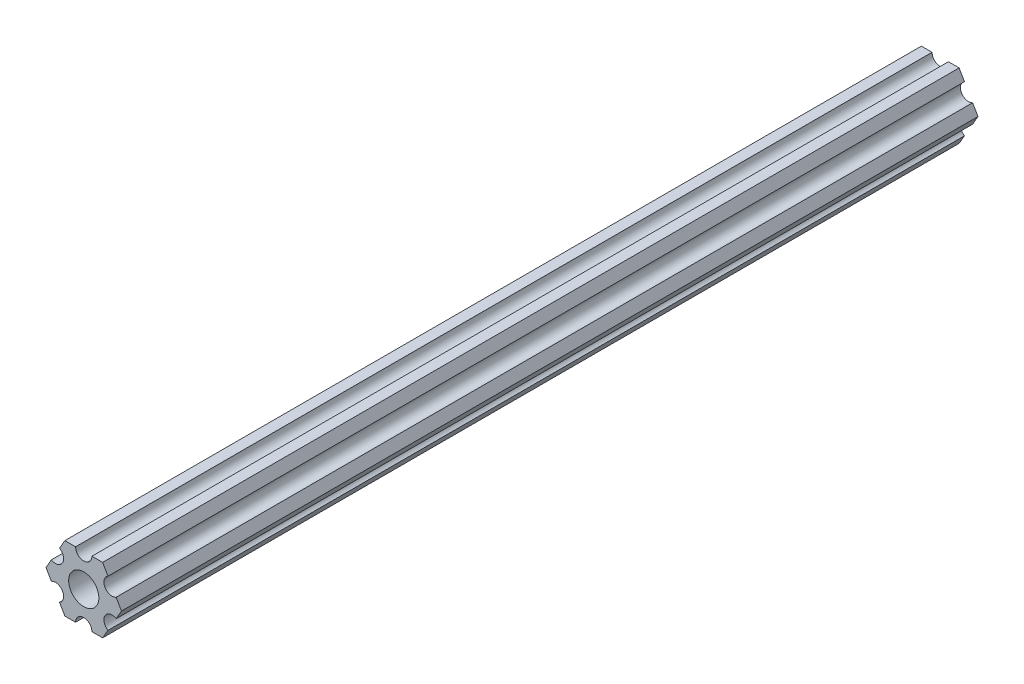
ISO-10303-21;
HEADER;
FILE_DESCRIPTION(('STEP AP214'),'2;1');
FILE_NAME('part.step','',(''),(''),'','','');
FILE_SCHEMA(('AUTOMOTIVE_DESIGN { 1 0 10303 214 1 1 1 1 }'));
ENDSEC;
DATA;
#1=APPLICATION_CONTEXT('core data for automotive mechanical design processes');
#2=APPLICATION_PROTOCOL_DEFINITION('international standard','automotive_design',2000,#1);
#3=PRODUCT_CONTEXT('',#1,'mechanical');
#4=PRODUCT('Part','Part','',(#3));
#5=PRODUCT_RELATED_PRODUCT_CATEGORY('part','',(#4));
#6=PRODUCT_DEFINITION_FORMATION('','',#4);
#7=PRODUCT_DEFINITION_CONTEXT('part definition',#1,'design');
#8=PRODUCT_DEFINITION('design','',#6,#7);
#9=PRODUCT_DEFINITION_SHAPE('','',#8);
#10=(LENGTH_UNIT() NAMED_UNIT(*) SI_UNIT(.MILLI.,.METRE.));
#11=(NAMED_UNIT(*) PLANE_ANGLE_UNIT() SI_UNIT($,.RADIAN.));
#12=(NAMED_UNIT(*) SI_UNIT($,.STERADIAN.) SOLID_ANGLE_UNIT());
#13=UNCERTAINTY_MEASURE_WITH_UNIT(LENGTH_MEASURE(1.E-05),#10,'distance_accuracy_value','');
#14=(GEOMETRIC_REPRESENTATION_CONTEXT(3) GLOBAL_UNCERTAINTY_ASSIGNED_CONTEXT((#13)) GLOBAL_UNIT_ASSIGNED_CONTEXT((#10,
#11,#12)) REPRESENTATION_CONTEXT('',''));
#15=CARTESIAN_POINT('',(0.,0.,0.));
#16=DIRECTION('',(0.,0.,1.));
#17=DIRECTION('',(1.,0.,0.));
#18=AXIS2_PLACEMENT_3D('',#15,#16,#17);
#19=CARTESIAN_POINT('',(5.49926150638083,-3.17499966684068,166.37));
#20=DIRECTION('',(0.,0.,-1.));
#21=DIRECTION('',(-1.,0.,0.));
#22=AXIS2_PLACEMENT_3D('',#19,#20,#21);
#23=CYLINDRICAL_SURFACE('',#22,1.58750000000001);
#24=CARTESIAN_POINT('',(5.49926150638083,-3.17499966684068,0.));
#25=DIRECTION('',(0.,0.,1.));
#26=DIRECTION('',(1.,0.,0.));
#27=AXIS2_PLACEMENT_3D('',#24,#25,#26);
#28=CIRCLE('',#27,1.58750000000001);
#29=CARTESIAN_POINT('',(6.29301142309098,-1.80018429024546,0.));
#30=VERTEX_POINT('',#29);
#31=CARTESIAN_POINT('',(4.70551158967068,-4.54981504343589,0.));
#32=VERTEX_POINT('',#31);
#33=EDGE_CURVE('E189',#30,#32,#28,.T.);
#34=ORIENTED_EDGE('',*,*,#33,.F.);
#35=DIRECTION('',(0.,0.,-1.));
#36=VECTOR('',#35,1.);
#37=CARTESIAN_POINT('',(6.29301142309098,-1.80018429024546,166.37));
#38=LINE('',#37,#36);
#39=CARTESIAN_POINT('',(6.29301142309098,-1.80018429024546,166.37));
#40=VERTEX_POINT('',#39);
#41=EDGE_CURVE('E11',#40,#30,#38,.T.);
#42=ORIENTED_EDGE('',*,*,#41,.F.);
#43=CARTESIAN_POINT('',(5.49926150638083,-3.17499966684068,166.37));
#44=DIRECTION('',(0.,0.,1.));
#45=DIRECTION('',(1.,0.,0.));
#46=AXIS2_PLACEMENT_3D('',#43,#44,#45);
#47=CIRCLE('',#46,1.58750000000001);
#48=CARTESIAN_POINT('',(4.70551158967068,-4.54981504343589,166.37));
#49=VERTEX_POINT('',#48);
#50=EDGE_CURVE('E240',#40,#49,#47,.T.);
#51=ORIENTED_EDGE('',*,*,#50,.T.);
#52=DIRECTION('',(0.,0.,-1.));
#53=VECTOR('',#52,1.);
#54=CARTESIAN_POINT('',(4.70551158967068,-4.54981504343589,166.37));
#55=LINE('',#54,#53);
#56=EDGE_CURVE('E35',#49,#32,#55,.T.);
#57=ORIENTED_EDGE('',*,*,#56,.T.);
#58=EDGE_LOOP('',(#34,#42,#51,#57));
#59=FACE_BOUND('',#58,.T.);
#60=ADVANCED_FACE('F32',(#59),#23,.F.);
#61=CARTESIAN_POINT('',(7.33234841870826,4.44212518961143E-07,166.37));
#62=DIRECTION('',(0.866025434075723,-0.499999947533953,0.));
#63=DIRECTION('',(0.499999947533953,0.866025434075723,0.));
#64=AXIS2_PLACEMENT_3D('',#61,#62,#63);
#65=PLANE('',#64);
#66=DIRECTION('',(-0.499999947533953,-0.866025434075723,0.));
#67=VECTOR('',#66,1.);
#68=CARTESIAN_POINT('',(7.33234841870826,4.44212518961143E-07,0.));
#69=LINE('',#68,#67);
#70=CARTESIAN_POINT('',(7.33234841870826,4.44212518961143E-07,0.));
#71=VERTEX_POINT('',#70);
#72=EDGE_CURVE('E238',#71,#30,#69,.T.);
#73=ORIENTED_EDGE('',*,*,#72,.F.);
#74=DIRECTION('',(0.,0.,-1.));
#75=VECTOR('',#74,1.);
#76=CARTESIAN_POINT('',(7.33234841870826,4.44212518961143E-07,166.37));
#77=LINE('',#76,#75);
#78=CARTESIAN_POINT('',(7.33234841870826,4.44212518961143E-07,166.37));
#79=VERTEX_POINT('',#78);
#80=EDGE_CURVE('E41',#79,#71,#77,.T.);
#81=ORIENTED_EDGE('',*,*,#80,.F.);
#82=DIRECTION('',(-0.499999947533953,-0.866025434075723,0.));
#83=VECTOR('',#82,1.);
#84=CARTESIAN_POINT('',(7.33234841870826,4.44212518961143E-07,166.37));
#85=LINE('',#84,#83);
#86=EDGE_CURVE('E179',#79,#40,#85,.T.);
#87=ORIENTED_EDGE('',*,*,#86,.T.);
#88=ORIENTED_EDGE('',*,*,#41,.T.);
#89=EDGE_LOOP('',(#73,#81,#87,#88));
#90=FACE_BOUND('',#89,.T.);
#91=ADVANCED_FACE('F272',(#90),#65,.T.);
#92=CARTESIAN_POINT('',(6.29301120497139,1.80018505273895,166.37));
#93=DIRECTION('',(0.866025373493145,0.500000052466056,0.));
#94=DIRECTION('',(-0.500000052466056,0.866025373493145,0.));
#95=AXIS2_PLACEMENT_3D('',#92,#93,#94);
#96=PLANE('',#95);
#97=DIRECTION('',(0.500000052466056,-0.866025373493145,0.));
#98=VECTOR('',#97,1.);
#99=CARTESIAN_POINT('',(6.29301120497139,1.80018505273895,0.));
#100=LINE('',#99,#98);
#101=CARTESIAN_POINT('',(6.29301120497139,1.80018505273895,0.));
#102=VERTEX_POINT('',#101);
#103=EDGE_CURVE('E166',#102,#71,#100,.T.);
#104=ORIENTED_EDGE('',*,*,#103,.F.);
#105=DIRECTION('',(0.,0.,-1.));
#106=VECTOR('',#105,1.);
#107=CARTESIAN_POINT('',(6.29301120497139,1.80018505273895,166.37));
#108=LINE('',#107,#106);
#109=CARTESIAN_POINT('',(6.29301120497139,1.80018505273895,166.37));
#110=VERTEX_POINT('',#109);
#111=EDGE_CURVE('E161',#110,#102,#108,.T.);
#112=ORIENTED_EDGE('',*,*,#111,.F.);
#113=DIRECTION('',(0.500000052466056,-0.866025373493145,0.));
#114=VECTOR('',#113,1.);
#115=CARTESIAN_POINT('',(6.29301120497139,1.80018505273895,166.37));
#116=LINE('',#115,#114);
#117=EDGE_CURVE('E164',#110,#79,#116,.T.);
#118=ORIENTED_EDGE('',*,*,#117,.T.);
#119=ORIENTED_EDGE('',*,*,#80,.T.);
#120=EDGE_LOOP('',(#104,#112,#118,#119));
#121=FACE_BOUND('',#120,.T.);
#122=ADVANCED_FACE('F163',(#121),#96,.T.);
#123=CARTESIAN_POINT('',(5.49926112168153,3.17500033315932,166.37));
#124=DIRECTION('',(0.,0.,-1.));
#125=DIRECTION('',(-1.,0.,0.));
#126=AXIS2_PLACEMENT_3D('',#123,#124,#125);
#127=CYLINDRICAL_SURFACE('',#126,1.5875);
#128=CARTESIAN_POINT('',(5.49926112168153,3.17500033315932,0.));
#129=DIRECTION('',(0.,0.,1.));
#130=DIRECTION('',(1.,0.,0.));
#131=AXIS2_PLACEMENT_3D('',#128,#129,#130);
#132=CIRCLE('',#131,1.5875);
#133=CARTESIAN_POINT('',(4.70551103839166,4.54981561357968,0.));
#134=VERTEX_POINT('',#133);
#135=EDGE_CURVE('E235',#134,#102,#132,.T.);
#136=ORIENTED_EDGE('',*,*,#135,.F.);
#137=DIRECTION('',(0.,0.,-1.));
#138=VECTOR('',#137,1.);
#139=CARTESIAN_POINT('',(4.70551103839166,4.54981561357968,166.37));
#140=LINE('',#139,#138);
#141=CARTESIAN_POINT('',(4.70551103839166,4.54981561357968,166.37));
#142=VERTEX_POINT('',#141);
#143=EDGE_CURVE('E171',#142,#134,#140,.T.);
#144=ORIENTED_EDGE('',*,*,#143,.F.);
#145=CARTESIAN_POINT('',(5.49926112168153,3.17500033315932,166.37));
#146=DIRECTION('',(0.,0.,1.));
#147=DIRECTION('',(1.,0.,0.));
#148=AXIS2_PLACEMENT_3D('',#145,#146,#147);
#149=CIRCLE('',#148,1.5875);
#150=EDGE_CURVE('E177',#142,#110,#149,.T.);
#151=ORIENTED_EDGE('',*,*,#150,.T.);
#152=ORIENTED_EDGE('',*,*,#111,.T.);
#153=EDGE_LOOP('',(#136,#144,#151,#152));
#154=FACE_BOUND('',#153,.T.);
#155=ADVANCED_FACE('F181',(#154),#127,.F.);
#156=CARTESIAN_POINT('',(3.66617382465472,6.35000022210622,166.37));
#157=DIRECTION('',(0.866025373493145,0.500000052466056,0.));
#158=DIRECTION('',(-0.500000052466056,0.866025373493145,0.));
#159=AXIS2_PLACEMENT_3D('',#156,#157,#158);
#160=PLANE('',#159);
#161=DIRECTION('',(0.500000052466056,-0.866025373493145,0.));
#162=VECTOR('',#161,1.);
#163=CARTESIAN_POINT('',(3.66617382465472,6.35000022210622,0.));
#164=LINE('',#163,#162);
#165=CARTESIAN_POINT('',(3.66617382465472,6.35000022210622,0.));
#166=VERTEX_POINT('',#165);
#167=EDGE_CURVE('E232',#166,#134,#164,.T.);
#168=ORIENTED_EDGE('',*,*,#167,.F.);
#169=DIRECTION('',(0.,0.,-1.));
#170=VECTOR('',#169,1.);
#171=CARTESIAN_POINT('',(3.66617382465472,6.35000022210622,166.37));
#172=LINE('',#171,#170);
#173=CARTESIAN_POINT('',(3.66617382465472,6.35000022210622,166.37));
#174=VERTEX_POINT('',#173);
#175=EDGE_CURVE('E244',#174,#166,#172,.T.);
#176=ORIENTED_EDGE('',*,*,#175,.F.);
#177=DIRECTION('',(0.500000052466056,-0.866025373493145,0.));
#178=VECTOR('',#177,1.);
#179=CARTESIAN_POINT('',(3.66617382465472,6.35000022210622,166.37));
#180=LINE('',#179,#178);
#181=EDGE_CURVE('E182',#174,#142,#180,.T.);
#182=ORIENTED_EDGE('',*,*,#181,.T.);
#183=ORIENTED_EDGE('',*,*,#143,.T.);
#184=EDGE_LOOP('',(#168,#176,#182,#183));
#185=FACE_BOUND('',#184,.T.);
#186=ADVANCED_FACE('F285',(#185),#160,.T.);
#187=CARTESIAN_POINT('',(1.58749961530066,6.35000022210622,166.37));
#188=DIRECTION('',(0.,1.,0.));
#189=DIRECTION('',(0.,0.,1.));
#190=AXIS2_PLACEMENT_3D('',#187,#188,#189);
#191=PLANE('',#190);
#192=DIRECTION('',(1.,0.,0.));
#193=VECTOR('',#192,1.);
#194=CARTESIAN_POINT('',(1.58749961530066,6.35000022210622,0.));
#195=LINE('',#194,#193);
#196=CARTESIAN_POINT('',(1.58749961530066,6.35000022210622,0.));
#197=VERTEX_POINT('',#196);
#198=EDGE_CURVE('E229',#197,#166,#195,.T.);
#199=ORIENTED_EDGE('',*,*,#198,.F.);
#200=DIRECTION('',(0.,0.,-1.));
#201=VECTOR('',#200,1.);
#202=CARTESIAN_POINT('',(1.58749961530066,6.35000022210622,166.37));
#203=LINE('',#202,#201);
#204=CARTESIAN_POINT('',(1.58749961530066,6.35000022210622,166.37));
#205=VERTEX_POINT('',#204);
#206=EDGE_CURVE('E246',#205,#197,#203,.T.);
#207=ORIENTED_EDGE('',*,*,#206,.F.);
#208=DIRECTION('',(1.,0.,0.));
#209=VECTOR('',#208,1.);
#210=CARTESIAN_POINT('',(1.58749961530066,6.35000022210622,166.37));
#211=LINE('',#210,#209);
#212=EDGE_CURVE('E184',#205,#174,#211,.T.);
#213=ORIENTED_EDGE('',*,*,#212,.T.);
#214=ORIENTED_EDGE('',*,*,#175,.T.);
#215=EDGE_LOOP('',(#199,#207,#213,#214));
#216=FACE_BOUND('',#215,.T.);
#217=ADVANCED_FACE('F288',(#216),#191,.T.);
#218=CARTESIAN_POINT('',(-3.84699344189937E-07,6.35000022210623,166.37));
#219=DIRECTION('',(0.,0.,-1.));
#220=DIRECTION('',(-1.,0.,0.));
#221=AXIS2_PLACEMENT_3D('',#218,#219,#220);
#222=CYLINDRICAL_SURFACE('',#221,1.5875);
#223=CARTESIAN_POINT('',(-3.84699344189937E-07,6.35000022210623,0.));
#224=DIRECTION('',(0.,0.,1.));
#225=DIRECTION('',(1.,0.,0.));
#226=AXIS2_PLACEMENT_3D('',#223,#224,#225);
#227=CIRCLE('',#226,1.5875);
#228=CARTESIAN_POINT('',(-1.58750038469935,6.35000022210622,0.));
#229=VERTEX_POINT('',#228);
#230=EDGE_CURVE('E226',#229,#197,#227,.T.);
#231=ORIENTED_EDGE('',*,*,#230,.F.);
#232=DIRECTION('',(0.,0.,-1.));
#233=VECTOR('',#232,1.);
#234=CARTESIAN_POINT('',(-1.58750038469935,6.35000022210622,166.37));
#235=LINE('',#234,#233);
#236=CARTESIAN_POINT('',(-1.58750038469935,6.35000022210622,166.37));
#237=VERTEX_POINT('',#236);
#238=EDGE_CURVE('E248',#237,#229,#235,.T.);
#239=ORIENTED_EDGE('',*,*,#238,.F.);
#240=CARTESIAN_POINT('',(-3.84699344189937E-07,6.35000022210623,166.37));
#241=DIRECTION('',(0.,0.,1.));
#242=DIRECTION('',(1.,0.,0.));
#243=AXIS2_PLACEMENT_3D('',#240,#241,#242);
#244=CIRCLE('',#243,1.5875);
#245=EDGE_CURVE('E393',#237,#205,#244,.T.);
#246=ORIENTED_EDGE('',*,*,#245,.T.);
#247=ORIENTED_EDGE('',*,*,#206,.T.);
#248=EDGE_LOOP('',(#231,#239,#246,#247));
#249=FACE_BOUND('',#248,.T.);
#250=ADVANCED_FACE('F292',(#249),#222,.F.);
#251=CARTESIAN_POINT('',(-3.66617454558253,6.35000022210623,166.37));
#252=DIRECTION('',(0.,1.,0.));
#253=DIRECTION('',(-1.,0.,0.));
#254=AXIS2_PLACEMENT_3D('',#251,#252,#253);
#255=PLANE('',#254);
#256=DIRECTION('',(1.,0.,0.));
#257=VECTOR('',#256,1.);
#258=CARTESIAN_POINT('',(-3.66617454558253,6.35000022210623,0.));
#259=LINE('',#258,#257);
#260=CARTESIAN_POINT('',(-3.66617454558253,6.35000022210623,0.));
#261=VERTEX_POINT('',#260);
#262=EDGE_CURVE('E223',#261,#229,#259,.T.);
#263=ORIENTED_EDGE('',*,*,#262,.F.);
#264=DIRECTION('',(0.,0.,-1.));
#265=VECTOR('',#264,1.);
#266=CARTESIAN_POINT('',(-3.66617454558253,6.35000022210623,166.37));
#267=LINE('',#266,#265);
#268=CARTESIAN_POINT('',(-3.66617454558253,6.35000022210623,166.37));
#269=VERTEX_POINT('',#268);
#270=EDGE_CURVE('E250',#269,#261,#267,.T.);
#271=ORIENTED_EDGE('',*,*,#270,.F.);
#272=DIRECTION('',(1.,0.,0.));
#273=VECTOR('',#272,1.);
#274=CARTESIAN_POINT('',(-3.66617454558253,6.35000022210623,166.37));
#275=LINE('',#274,#273);
#276=EDGE_CURVE('E390',#269,#237,#275,.T.);
#277=ORIENTED_EDGE('',*,*,#276,.T.);
#278=ORIENTED_EDGE('',*,*,#238,.T.);
#279=EDGE_LOOP('',(#263,#271,#277,#278));
#280=FACE_BOUND('',#279,.T.);
#281=ADVANCED_FACE('F296',(#280),#255,.T.);
#282=CARTESIAN_POINT('',(-4.70551145677116,4.5498155228298,166.37));
#283=DIRECTION('',(-0.866025447431972,0.499999924400247,0.));
#284=DIRECTION('',(-0.499999924400248,-0.866025447431972,0.));
#285=AXIS2_PLACEMENT_3D('',#282,#283,#284);
#286=PLANE('',#285);
#287=DIRECTION('',(0.499999924400248,0.866025447431972,0.));
#288=VECTOR('',#287,1.);
#289=CARTESIAN_POINT('',(-4.70551145677116,4.5498155228298,0.));
#290=LINE('',#289,#288);
#291=CARTESIAN_POINT('',(-4.70551145677116,4.5498155228298,0.));
#292=VERTEX_POINT('',#291);
#293=EDGE_CURVE('E220',#292,#261,#290,.T.);
#294=ORIENTED_EDGE('',*,*,#293,.F.);
#295=DIRECTION('',(0.,0.,-1.));
#296=VECTOR('',#295,1.);
#297=CARTESIAN_POINT('',(-4.70551145677116,4.5498155228298,166.37));
#298=LINE('',#297,#296);
#299=CARTESIAN_POINT('',(-4.70551145677116,4.5498155228298,166.37));
#300=VERTEX_POINT('',#299);
#301=EDGE_CURVE('E252',#300,#292,#298,.T.);
#302=ORIENTED_EDGE('',*,*,#301,.F.);
#303=DIRECTION('',(0.499999924400248,0.866025447431972,0.));
#304=VECTOR('',#303,1.);
#305=CARTESIAN_POINT('',(-4.70551145677116,4.5498155228298,166.37));
#306=LINE('',#305,#304);
#307=EDGE_CURVE('E387',#300,#269,#306,.T.);
#308=ORIENTED_EDGE('',*,*,#307,.T.);
#309=ORIENTED_EDGE('',*,*,#270,.T.);
#310=EDGE_LOOP('',(#294,#302,#308,#309));
#311=FACE_BOUND('',#310,.T.);
#312=ADVANCED_FACE('F300',(#311),#286,.T.);
#313=CARTESIAN_POINT('',(-5.49926133675655,3.17500012503154,166.37));
#314=DIRECTION('',(0.,0.,-1.));
#315=DIRECTION('',(-1.,0.,0.));
#316=AXIS2_PLACEMENT_3D('',#313,#314,#315);
#317=CYLINDRICAL_SURFACE('',#316,1.5875);
#318=CARTESIAN_POINT('',(-5.49926133675655,3.17500012503154,0.));
#319=DIRECTION('',(0.,0.,1.));
#320=DIRECTION('',(1.,0.,0.));
#321=AXIS2_PLACEMENT_3D('',#318,#319,#320);
#322=CIRCLE('',#321,1.5875);
#323=CARTESIAN_POINT('',(-6.29301121674195,1.80018472723328,0.));
#324=VERTEX_POINT('',#323);
#325=EDGE_CURVE('E217',#324,#292,#322,.T.);
#326=ORIENTED_EDGE('',*,*,#325,.F.);
#327=DIRECTION('',(0.,0.,-1.));
#328=VECTOR('',#327,1.);
#329=CARTESIAN_POINT('',(-6.29301121674195,1.80018472723328,166.37));
#330=LINE('',#329,#328);
#331=CARTESIAN_POINT('',(-6.29301121674195,1.80018472723328,166.37));
#332=VERTEX_POINT('',#331);
#333=EDGE_CURVE('E254',#332,#324,#330,.T.);
#334=ORIENTED_EDGE('',*,*,#333,.F.);
#335=CARTESIAN_POINT('',(-5.49926133675655,3.17500012503154,166.37));
#336=DIRECTION('',(0.,0.,1.));
#337=DIRECTION('',(1.,0.,0.));
#338=AXIS2_PLACEMENT_3D('',#335,#336,#337);
#339=CIRCLE('',#338,1.5875);
#340=EDGE_CURVE('E384',#332,#300,#339,.T.);
#341=ORIENTED_EDGE('',*,*,#340,.T.);
#342=ORIENTED_EDGE('',*,*,#301,.T.);
#343=EDGE_LOOP('',(#326,#334,#341,#342));
#344=FACE_BOUND('',#343,.T.);
#345=ADVANCED_FACE('F304',(#344),#317,.F.);
#346=CARTESIAN_POINT('',(-7.33234807945963,1.11911014219708E-07,166.37));
#347=DIRECTION('',(-0.866025447431972,0.499999924400247,0.));
#348=DIRECTION('',(-0.499999924400247,-0.866025447431972,0.));
#349=AXIS2_PLACEMENT_3D('',#346,#347,#348);
#350=PLANE('',#349);
#351=DIRECTION('',(0.499999924400247,0.866025447431972,0.));
#352=VECTOR('',#351,1.);
#353=CARTESIAN_POINT('',(-7.33234807945963,1.11911014219708E-07,0.));
#354=LINE('',#353,#352);
#355=CARTESIAN_POINT('',(-7.33234807945963,1.11911014219708E-07,0.));
#356=VERTEX_POINT('',#355);
#357=EDGE_CURVE('E214',#356,#324,#354,.T.);
#358=ORIENTED_EDGE('',*,*,#357,.F.);
#359=DIRECTION('',(0.,0.,-1.));
#360=VECTOR('',#359,1.);
#361=CARTESIAN_POINT('',(-7.33234807945963,1.11911014219708E-07,166.37));
#362=LINE('',#361,#360);
#363=CARTESIAN_POINT('',(-7.33234807945963,1.11911014219708E-07,166.37));
#364=VERTEX_POINT('',#363);
#365=EDGE_CURVE('E256',#364,#356,#362,.T.);
#366=ORIENTED_EDGE('',*,*,#365,.F.);
#367=DIRECTION('',(0.499999924400247,0.866025447431972,0.));
#368=VECTOR('',#367,1.);
#369=CARTESIAN_POINT('',(-7.33234807945963,1.11911014219708E-07,166.37));
#370=LINE('',#369,#368);
#371=EDGE_CURVE('E381',#364,#332,#370,.T.);
#372=ORIENTED_EDGE('',*,*,#371,.T.);
#373=ORIENTED_EDGE('',*,*,#333,.T.);
#374=EDGE_LOOP('',(#358,#366,#372,#373));
#375=FACE_BOUND('',#374,.T.);
#376=ADVANCED_FACE('F308',(#375),#350,.T.);
#377=CARTESIAN_POINT('',(-6.29301096189761,-1.800184552142,166.37));
#378=DIRECTION('',(-0.866025400205644,-0.500000006198653,0.));
#379=DIRECTION('',(0.500000006198654,-0.866025400205644,0.));
#380=AXIS2_PLACEMENT_3D('',#377,#378,#379);
#381=PLANE('',#380);
#382=DIRECTION('',(-0.500000006198653,0.866025400205644,0.));
#383=VECTOR('',#382,1.);
#384=CARTESIAN_POINT('',(-6.29301096189761,-1.800184552142,0.));
#385=LINE('',#384,#383);
#386=CARTESIAN_POINT('',(-6.29301096189761,-1.800184552142,0.));
#387=VERTEX_POINT('',#386);
#388=EDGE_CURVE('E211',#387,#356,#385,.T.);
#389=ORIENTED_EDGE('',*,*,#388,.F.);
#390=DIRECTION('',(0.,0.,-1.));
#391=VECTOR('',#390,1.);
#392=CARTESIAN_POINT('',(-6.29301096189761,-1.800184552142,166.37));
#393=LINE('',#392,#391);
#394=CARTESIAN_POINT('',(-6.29301096189761,-1.800184552142,166.37));
#395=VERTEX_POINT('',#394);
#396=EDGE_CURVE('E258',#395,#387,#393,.T.);
#397=ORIENTED_EDGE('',*,*,#396,.F.);
#398=DIRECTION('',(-0.500000006198653,0.866025400205644,0.));
#399=VECTOR('',#398,1.);
#400=CARTESIAN_POINT('',(-6.29301096189761,-1.800184552142,166.37));
#401=LINE('',#400,#399);
#402=EDGE_CURVE('E378',#395,#364,#401,.T.);
#403=ORIENTED_EDGE('',*,*,#402,.T.);
#404=ORIENTED_EDGE('',*,*,#365,.T.);
#405=EDGE_LOOP('',(#389,#397,#403,#404));
#406=FACE_BOUND('',#405,.T.);
#407=ADVANCED_FACE('F312',(#406),#381,.T.);
#408=CARTESIAN_POINT('',(-5.49926095205725,-3.17499987496846,166.37));
#409=DIRECTION('',(0.,0.,-1.));
#410=DIRECTION('',(-1.,0.,0.));
#411=AXIS2_PLACEMENT_3D('',#408,#409,#410);
#412=CYLINDRICAL_SURFACE('',#411,1.5875);
#413=CARTESIAN_POINT('',(-5.49926095205725,-3.17499987496846,0.));
#414=DIRECTION('',(0.,0.,1.));
#415=DIRECTION('',(1.,0.,0.));
#416=AXIS2_PLACEMENT_3D('',#413,#414,#415);
#417=CIRCLE('',#416,1.5875);
#418=CARTESIAN_POINT('',(-4.70551094221689,-4.54981519779492,0.));
#419=VERTEX_POINT('',#418);
#420=EDGE_CURVE('E208',#419,#387,#417,.T.);
#421=ORIENTED_EDGE('',*,*,#420,.F.);
#422=DIRECTION('',(0.,0.,-1.));
#423=VECTOR('',#422,1.);
#424=CARTESIAN_POINT('',(-4.70551094221689,-4.54981519779492,166.37));
#425=LINE('',#424,#423);
#426=CARTESIAN_POINT('',(-4.70551094221689,-4.54981519779492,166.37));
#427=VERTEX_POINT('',#426);
#428=EDGE_CURVE('E260',#427,#419,#425,.T.);
#429=ORIENTED_EDGE('',*,*,#428,.F.);
#430=CARTESIAN_POINT('',(-5.49926095205725,-3.17499987496846,166.37));
#431=DIRECTION('',(0.,0.,1.));
#432=DIRECTION('',(1.,0.,0.));
#433=AXIS2_PLACEMENT_3D('',#430,#431,#432);
#434=CIRCLE('',#433,1.5875);
#435=EDGE_CURVE('E375',#427,#395,#434,.T.);
#436=ORIENTED_EDGE('',*,*,#435,.T.);
#437=ORIENTED_EDGE('',*,*,#396,.T.);
#438=EDGE_LOOP('',(#421,#429,#436,#437));
#439=FACE_BOUND('',#438,.T.);
#440=ADVANCED_FACE('F316',(#439),#412,.F.);
#441=CARTESIAN_POINT('',(-3.66617382465481,-6.34999986184805,166.37));
#442=DIRECTION('',(-0.866025400205645,-0.500000006198653,0.));
#443=DIRECTION('',(0.500000006198653,-0.866025400205645,0.));
#444=AXIS2_PLACEMENT_3D('',#441,#442,#443);
#445=PLANE('',#444);
#446=DIRECTION('',(-0.500000006198653,0.866025400205644,0.));
#447=VECTOR('',#446,1.);
#448=CARTESIAN_POINT('',(-3.66617382465481,-6.34999986184805,0.));
#449=LINE('',#448,#447);
#450=CARTESIAN_POINT('',(-3.66617382465481,-6.34999986184805,0.));
#451=VERTEX_POINT('',#450);
#452=EDGE_CURVE('E205',#451,#419,#449,.T.);
#453=ORIENTED_EDGE('',*,*,#452,.F.);
#454=DIRECTION('',(0.,0.,-1.));
#455=VECTOR('',#454,1.);
#456=CARTESIAN_POINT('',(-3.66617382465481,-6.34999986184805,166.37));
#457=LINE('',#456,#455);
#458=CARTESIAN_POINT('',(-3.66617382465481,-6.34999986184805,166.37));
#459=VERTEX_POINT('',#458);
#460=EDGE_CURVE('E262',#459,#451,#457,.T.);
#461=ORIENTED_EDGE('',*,*,#460,.F.);
#462=DIRECTION('',(-0.500000006198653,0.866025400205644,0.));
#463=VECTOR('',#462,1.);
#464=CARTESIAN_POINT('',(-3.66617382465481,-6.34999986184805,166.37));
#465=LINE('',#464,#463);
#466=EDGE_CURVE('E372',#459,#427,#465,.T.);
#467=ORIENTED_EDGE('',*,*,#466,.T.);
#468=ORIENTED_EDGE('',*,*,#428,.T.);
#469=EDGE_LOOP('',(#453,#461,#467,#468));
#470=FACE_BOUND('',#469,.T.);
#471=ADVANCED_FACE('F320',(#470),#445,.T.);
#472=CARTESIAN_POINT('',(-1.58749961530074,-6.34999986184805,166.37));
#473=DIRECTION('',(0.,-1.,0.));
#474=DIRECTION('',(1.,0.,0.));
#475=AXIS2_PLACEMENT_3D('',#472,#473,#474);
#476=PLANE('',#475);
#477=DIRECTION('',(-1.,0.,0.));
#478=VECTOR('',#477,1.);
#479=CARTESIAN_POINT('',(-1.58749961530074,-6.34999986184805,0.));
#480=LINE('',#479,#478);
#481=CARTESIAN_POINT('',(-1.58749961530074,-6.34999986184805,0.));
#482=VERTEX_POINT('',#481);
#483=EDGE_CURVE('E202',#482,#451,#480,.T.);
#484=ORIENTED_EDGE('',*,*,#483,.F.);
#485=DIRECTION('',(0.,0.,-1.));
#486=VECTOR('',#485,1.);
#487=CARTESIAN_POINT('',(-1.58749961530074,-6.34999986184805,166.37));
#488=LINE('',#487,#486);
#489=CARTESIAN_POINT('',(-1.58749961530074,-6.34999986184805,166.37));
#490=VERTEX_POINT('',#489);
#491=EDGE_CURVE('E264',#490,#482,#488,.T.);
#492=ORIENTED_EDGE('',*,*,#491,.F.);
#493=DIRECTION('',(-1.,0.,0.));
#494=VECTOR('',#493,1.);
#495=CARTESIAN_POINT('',(-1.58749961530074,-6.34999986184805,166.37));
#496=LINE('',#495,#494);
#497=EDGE_CURVE('E369',#490,#459,#496,.T.);
#498=ORIENTED_EDGE('',*,*,#497,.T.);
#499=ORIENTED_EDGE('',*,*,#460,.T.);
#500=EDGE_LOOP('',(#484,#492,#498,#499));
#501=FACE_BOUND('',#500,.T.);
#502=ADVANCED_FACE('F324',(#501),#476,.T.);
#503=CARTESIAN_POINT('',(3.8469926204343E-07,-6.34999986184805,166.37));
#504=DIRECTION('',(0.,0.,-1.));
#505=DIRECTION('',(-1.,0.,0.));
#506=AXIS2_PLACEMENT_3D('',#503,#504,#505);
#507=CYLINDRICAL_SURFACE('',#506,1.5875);
#508=CARTESIAN_POINT('',(3.8469926204343E-07,-6.34999986184805,0.));
#509=DIRECTION('',(0.,0.,1.));
#510=DIRECTION('',(1.,0.,0.));
#511=AXIS2_PLACEMENT_3D('',#508,#509,#510);
#512=CIRCLE('',#511,1.5875);
#513=CARTESIAN_POINT('',(1.58750038469926,-6.34999986184804,0.));
#514=VERTEX_POINT('',#513);
#515=EDGE_CURVE('E199',#514,#482,#512,.T.);
#516=ORIENTED_EDGE('',*,*,#515,.F.);
#517=DIRECTION('',(0.,0.,-1.));
#518=VECTOR('',#517,1.);
#519=CARTESIAN_POINT('',(1.58750038469926,-6.34999986184804,166.37));
#520=LINE('',#519,#518);
#521=CARTESIAN_POINT('',(1.58750038469926,-6.34999986184804,166.37));
#522=VERTEX_POINT('',#521);
#523=EDGE_CURVE('E266',#522,#514,#520,.T.);
#524=ORIENTED_EDGE('',*,*,#523,.F.);
#525=CARTESIAN_POINT('',(3.8469926204343E-07,-6.34999986184805,166.37));
#526=DIRECTION('',(0.,0.,1.));
#527=DIRECTION('',(1.,0.,0.));
#528=AXIS2_PLACEMENT_3D('',#525,#526,#527);
#529=CIRCLE('',#528,1.5875);
#530=EDGE_CURVE('E366',#522,#490,#529,.T.);
#531=ORIENTED_EDGE('',*,*,#530,.T.);
#532=ORIENTED_EDGE('',*,*,#491,.T.);
#533=EDGE_LOOP('',(#516,#524,#531,#532));
#534=FACE_BOUND('',#533,.T.);
#535=ADVANCED_FACE('F328',(#534),#507,.F.);
#536=CARTESIAN_POINT('',(3.66617454558244,-6.34999986184805,166.37));
#537=DIRECTION('',(0.,-1.,0.));
#538=DIRECTION('',(1.,0.,0.));
#539=AXIS2_PLACEMENT_3D('',#536,#537,#538);
#540=PLANE('',#539);
#541=DIRECTION('',(-1.,0.,0.));
#542=VECTOR('',#541,1.);
#543=CARTESIAN_POINT('',(3.66617454558244,-6.34999986184805,0.));
#544=LINE('',#543,#542);
#545=CARTESIAN_POINT('',(3.66617454558244,-6.34999986184805,0.));
#546=VERTEX_POINT('',#545);
#547=EDGE_CURVE('E196',#546,#514,#544,.T.);
#548=ORIENTED_EDGE('',*,*,#547,.F.);
#549=DIRECTION('',(0.,0.,-1.));
#550=VECTOR('',#549,1.);
#551=CARTESIAN_POINT('',(3.66617454558244,-6.34999986184805,166.37));
#552=LINE('',#551,#550);
#553=CARTESIAN_POINT('',(3.66617454558244,-6.34999986184805,166.37));
#554=VERTEX_POINT('',#553);
#555=EDGE_CURVE('E267',#554,#546,#552,.T.);
#556=ORIENTED_EDGE('',*,*,#555,.F.);
#557=DIRECTION('',(-1.,0.,0.));
#558=VECTOR('',#557,1.);
#559=CARTESIAN_POINT('',(3.66617454558244,-6.34999986184805,166.37));
#560=LINE('',#559,#558);
#561=EDGE_CURVE('E363',#554,#522,#560,.T.);
#562=ORIENTED_EDGE('',*,*,#561,.T.);
#563=ORIENTED_EDGE('',*,*,#523,.T.);
#564=EDGE_LOOP('',(#548,#556,#562,#563));
#565=FACE_BOUND('',#564,.T.);
#566=ADVANCED_FACE('F332',(#565),#540,.T.);
#567=CARTESIAN_POINT('',(4.70551158967068,-4.54981504343589,166.37));
#568=DIRECTION('',(0.866025434075723,-0.499999947533953,0.));
#569=DIRECTION('',(0.499999947533953,0.866025434075723,0.));
#570=AXIS2_PLACEMENT_3D('',#567,#568,#569);
#571=PLANE('',#570);
#572=DIRECTION('',(-0.499999947533953,-0.866025434075723,0.));
#573=VECTOR('',#572,1.);
#574=CARTESIAN_POINT('',(4.70551158967068,-4.54981504343589,0.));
#575=LINE('',#574,#573);
#576=EDGE_CURVE('E192',#32,#546,#575,.T.);
#577=ORIENTED_EDGE('',*,*,#576,.F.);
#578=ORIENTED_EDGE('',*,*,#56,.F.);
#579=DIRECTION('',(-0.499999947533953,-0.866025434075723,0.));
#580=VECTOR('',#579,1.);
#581=CARTESIAN_POINT('',(4.70551158967068,-4.54981504343589,166.37));
#582=LINE('',#581,#580);
#583=EDGE_CURVE('E361',#49,#554,#582,.T.);
#584=ORIENTED_EDGE('',*,*,#583,.T.);
#585=ORIENTED_EDGE('',*,*,#555,.T.);
#586=EDGE_LOOP('',(#577,#578,#584,#585));
#587=FACE_BOUND('',#586,.T.);
#588=ADVANCED_FACE('F269',(#587),#571,.T.);
#589=CARTESIAN_POINT('',(5.49926150638083,-3.17499966684068,166.37));
#590=DIRECTION('',(0.,0.,1.));
#591=DIRECTION('',(1.,0.,0.));
#592=AXIS2_PLACEMENT_3D('',#589,#590,#591);
#593=PLANE('',#592);
#594=CARTESIAN_POINT('',(0.,0.,166.37));
#595=DIRECTION('',(0.,0.,-1.));
#596=DIRECTION('',(1.,0.,0.));
#597=AXIS2_PLACEMENT_3D('',#594,#595,#596);
#598=CIRCLE('',#597,2.9337);
#599=CARTESIAN_POINT('',(2.9337,0.,166.37));
#600=VERTEX_POINT('',#599);
#601=EDGE_CURVE('E193',#600,#600,#598,.T.);
#602=ORIENTED_EDGE('',*,*,#601,.T.);
#603=EDGE_LOOP('',(#602));
#604=FACE_BOUND('',#603,.T.);
#605=ORIENTED_EDGE('',*,*,#50,.F.);
#606=ORIENTED_EDGE('',*,*,#86,.F.);
#607=ORIENTED_EDGE('',*,*,#117,.F.);
#608=ORIENTED_EDGE('',*,*,#150,.F.);
#609=ORIENTED_EDGE('',*,*,#181,.F.);
#610=ORIENTED_EDGE('',*,*,#212,.F.);
#611=ORIENTED_EDGE('',*,*,#245,.F.);
#612=ORIENTED_EDGE('',*,*,#276,.F.);
#613=ORIENTED_EDGE('',*,*,#307,.F.);
#614=ORIENTED_EDGE('',*,*,#340,.F.);
#615=ORIENTED_EDGE('',*,*,#371,.F.);
#616=ORIENTED_EDGE('',*,*,#402,.F.);
#617=ORIENTED_EDGE('',*,*,#435,.F.);
#618=ORIENTED_EDGE('',*,*,#466,.F.);
#619=ORIENTED_EDGE('',*,*,#497,.F.);
#620=ORIENTED_EDGE('',*,*,#530,.F.);
#621=ORIENTED_EDGE('',*,*,#561,.F.);
#622=ORIENTED_EDGE('',*,*,#583,.F.);
#623=EDGE_LOOP('',(#605,#606,#607,#608,#609,#610,#611,#612,#613,#614,#615,#616,#617,#618,#619,
#620,#621,#622));
#624=FACE_BOUND('',#623,.T.);
#625=ADVANCED_FACE('F175',(#604,#624),#593,.T.);
#626=CARTESIAN_POINT('',(5.49926150638083,-3.17499966684068,0.));
#627=DIRECTION('',(0.,0.,1.));
#628=DIRECTION('',(1.,0.,0.));
#629=AXIS2_PLACEMENT_3D('',#626,#627,#628);
#630=PLANE('',#629);
#631=CARTESIAN_POINT('',(0.,0.,0.));
#632=DIRECTION('',(0.,0.,-1.));
#633=DIRECTION('',(1.,0.,0.));
#634=AXIS2_PLACEMENT_3D('',#631,#632,#633);
#635=CIRCLE('',#634,2.9337);
#636=CARTESIAN_POINT('',(2.9337,0.,0.));
#637=VERTEX_POINT('',#636);
#638=EDGE_CURVE('E356',#637,#637,#635,.T.);
#639=ORIENTED_EDGE('',*,*,#638,.F.);
#640=EDGE_LOOP('',(#639));
#641=FACE_BOUND('',#640,.T.);
#642=ORIENTED_EDGE('',*,*,#33,.T.);
#643=ORIENTED_EDGE('',*,*,#576,.T.);
#644=ORIENTED_EDGE('',*,*,#547,.T.);
#645=ORIENTED_EDGE('',*,*,#515,.T.);
#646=ORIENTED_EDGE('',*,*,#483,.T.);
#647=ORIENTED_EDGE('',*,*,#452,.T.);
#648=ORIENTED_EDGE('',*,*,#420,.T.);
#649=ORIENTED_EDGE('',*,*,#388,.T.);
#650=ORIENTED_EDGE('',*,*,#357,.T.);
#651=ORIENTED_EDGE('',*,*,#325,.T.);
#652=ORIENTED_EDGE('',*,*,#293,.T.);
#653=ORIENTED_EDGE('',*,*,#262,.T.);
#654=ORIENTED_EDGE('',*,*,#230,.T.);
#655=ORIENTED_EDGE('',*,*,#198,.T.);
#656=ORIENTED_EDGE('',*,*,#167,.T.);
#657=ORIENTED_EDGE('',*,*,#135,.T.);
#658=ORIENTED_EDGE('',*,*,#103,.T.);
#659=ORIENTED_EDGE('',*,*,#72,.T.);
#660=EDGE_LOOP('',(#642,#643,#644,#645,#646,#647,#648,#649,#650,#651,#652,#653,#654,#655,#656,
#657,#658,#659));
#661=FACE_BOUND('',#660,.T.);
#662=ADVANCED_FACE('F271',(#641,#661),#630,.F.);
#663=CARTESIAN_POINT('',(0.,0.,166.37));
#664=DIRECTION('',(0.,0.,-1.));
#665=DIRECTION('',(-1.,0.,0.));
#666=AXIS2_PLACEMENT_3D('',#663,#664,#665);
#667=CYLINDRICAL_SURFACE('',#666,2.9337);
#668=ORIENTED_EDGE('',*,*,#601,.F.);
#669=EDGE_LOOP('',(#668));
#670=FACE_BOUND('',#669,.T.);
#671=ORIENTED_EDGE('',*,*,#638,.T.);
#672=EDGE_LOOP('',(#671));
#673=FACE_BOUND('',#672,.T.);
#674=ADVANCED_FACE('F344',(#670,#673),#667,.F.);
#675=CLOSED_SHELL('',(#60,#91,#122,#155,#186,#217,#250,#281,#312,#345,#376,#407,#440,#471,#502,
#535,#566,#588,#625,#662,#674));
#676=MANIFOLD_SOLID_BREP('B2',#675);
#677=ADVANCED_BREP_SHAPE_REPRESENTATION('',(#18,#676),#14);
#678=SHAPE_DEFINITION_REPRESENTATION(#9,#677);
ENDSEC;
END-ISO-10303-21;
